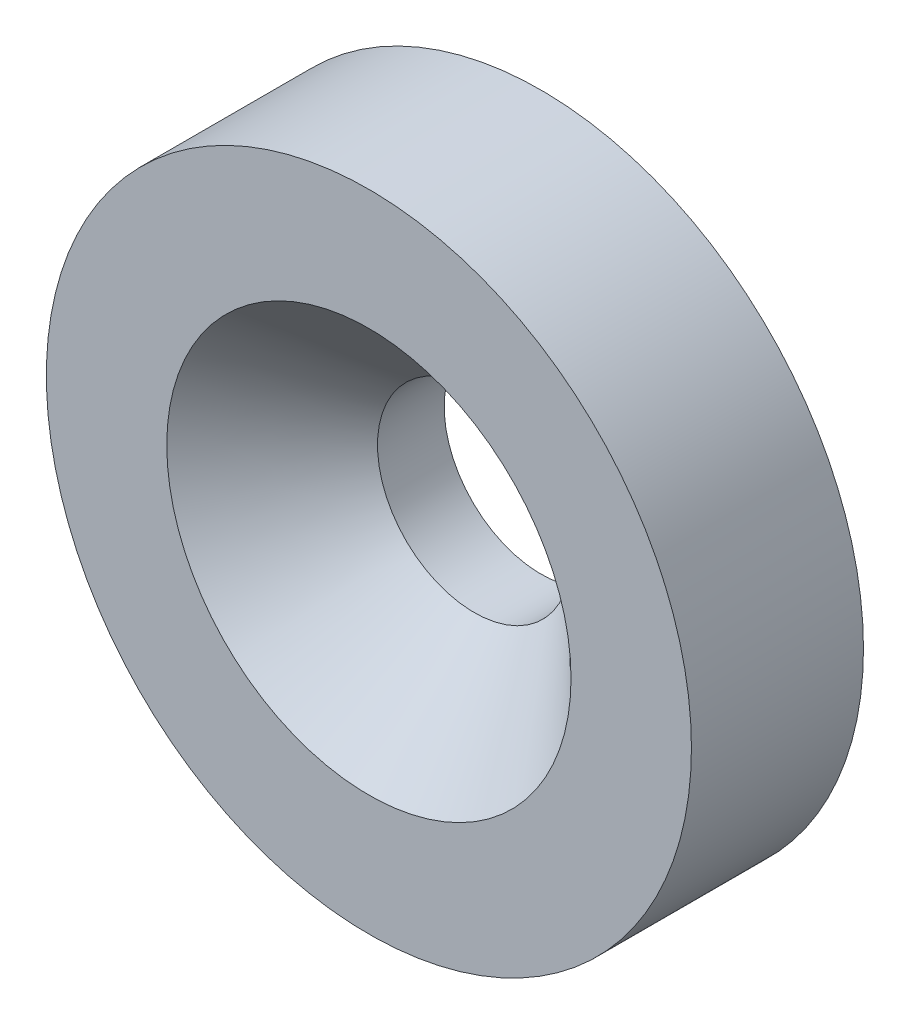
ISO-10303-21;
HEADER;
FILE_DESCRIPTION(('STEP AP214'),'2;1');
FILE_NAME('part.step','',(''),(''),'','','');
FILE_SCHEMA(('AUTOMOTIVE_DESIGN { 1 0 10303 214 1 1 1 1 }'));
ENDSEC;
DATA;
#1=APPLICATION_CONTEXT('core data for automotive mechanical design processes');
#2=APPLICATION_PROTOCOL_DEFINITION('international standard','automotive_design',2000,#1);
#3=PRODUCT_CONTEXT('',#1,'mechanical');
#4=PRODUCT('Part','Part','',(#3));
#5=PRODUCT_RELATED_PRODUCT_CATEGORY('part','',(#4));
#6=PRODUCT_DEFINITION_FORMATION('','',#4);
#7=PRODUCT_DEFINITION_CONTEXT('part definition',#1,'design');
#8=PRODUCT_DEFINITION('design','',#6,#7);
#9=PRODUCT_DEFINITION_SHAPE('','',#8);
#10=(LENGTH_UNIT() NAMED_UNIT(*) SI_UNIT(.MILLI.,.METRE.));
#11=(NAMED_UNIT(*) PLANE_ANGLE_UNIT() SI_UNIT($,.RADIAN.));
#12=(NAMED_UNIT(*) SI_UNIT($,.STERADIAN.) SOLID_ANGLE_UNIT());
#13=UNCERTAINTY_MEASURE_WITH_UNIT(LENGTH_MEASURE(1.E-05),#10,'distance_accuracy_value','');
#14=(GEOMETRIC_REPRESENTATION_CONTEXT(3) GLOBAL_UNCERTAINTY_ASSIGNED_CONTEXT((#13)) GLOBAL_UNIT_ASSIGNED_CONTEXT((#10,
#11,#12)) REPRESENTATION_CONTEXT('',''));
#15=CARTESIAN_POINT('',(0.,0.,0.));
#16=DIRECTION('',(0.,0.,1.));
#17=DIRECTION('',(1.,0.,0.));
#18=AXIS2_PLACEMENT_3D('',#15,#16,#17);
#19=CARTESIAN_POINT('',(0.,0.,-4.));
#20=DIRECTION('',(0.,0.,1.));
#21=DIRECTION('',(1.,0.,0.));
#22=AXIS2_PLACEMENT_3D('',#19,#20,#21);
#23=CYLINDRICAL_SURFACE('',#22,7.5);
#24=CARTESIAN_POINT('',(0.,0.,-4.));
#25=DIRECTION('',(0.,0.,1.));
#26=DIRECTION('',(1.,0.,0.));
#27=AXIS2_PLACEMENT_3D('',#24,#25,#26);
#28=CIRCLE('',#27,7.5);
#29=CARTESIAN_POINT('',(7.5,0.,-4.));
#30=VERTEX_POINT('',#29);
#31=EDGE_CURVE('E10',#30,#30,#28,.T.);
#32=ORIENTED_EDGE('',*,*,#31,.T.);
#33=EDGE_LOOP('',(#32));
#34=FACE_BOUND('',#33,.T.);
#35=CARTESIAN_POINT('',(0.,0.,0.));
#36=DIRECTION('',(0.,0.,1.));
#37=DIRECTION('',(1.,0.,0.));
#38=AXIS2_PLACEMENT_3D('',#35,#36,#37);
#39=CIRCLE('',#38,7.5);
#40=CARTESIAN_POINT('',(7.5,0.,0.));
#41=VERTEX_POINT('',#40);
#42=EDGE_CURVE('E38',#41,#41,#39,.T.);
#43=ORIENTED_EDGE('',*,*,#42,.F.);
#44=EDGE_LOOP('',(#43));
#45=FACE_BOUND('',#44,.T.);
#46=ADVANCED_FACE('F35',(#34,#45),#23,.T.);
#47=CARTESIAN_POINT('',(0.,0.,-4.));
#48=DIRECTION('',(0.,0.,1.));
#49=DIRECTION('',(1.,0.,0.));
#50=AXIS2_PLACEMENT_3D('',#47,#48,#49);
#51=PLANE('',#50);
#52=CARTESIAN_POINT('',(0.,0.,-4.));
#53=DIRECTION('',(0.,0.,1.));
#54=DIRECTION('',(1.,0.,0.));
#55=AXIS2_PLACEMENT_3D('',#52,#53,#54);
#56=CIRCLE('',#55,2.25);
#57=CARTESIAN_POINT('',(2.25,0.,-4.));
#58=VERTEX_POINT('',#57);
#59=EDGE_CURVE('E45',#58,#58,#56,.T.);
#60=ORIENTED_EDGE('',*,*,#59,.T.);
#61=EDGE_LOOP('',(#60));
#62=FACE_BOUND('',#61,.T.);
#63=ORIENTED_EDGE('',*,*,#31,.F.);
#64=EDGE_LOOP('',(#63));
#65=FACE_BOUND('',#64,.T.);
#66=ADVANCED_FACE('F62',(#62,#65),#51,.F.);
#67=CARTESIAN_POINT('',(0.,0.,0.));
#68=DIRECTION('',(0.,0.,1.));
#69=DIRECTION('',(1.,0.,0.));
#70=AXIS2_PLACEMENT_3D('',#67,#68,#69);
#71=PLANE('',#70);
#72=CARTESIAN_POINT('',(0.,0.,0.));
#73=DIRECTION('',(0.,0.,1.));
#74=DIRECTION('',(1.,0.,0.));
#75=AXIS2_PLACEMENT_3D('',#72,#73,#74);
#76=CIRCLE('',#75,4.7);
#77=CARTESIAN_POINT('',(4.7,0.,0.));
#78=VERTEX_POINT('',#77);
#79=EDGE_CURVE('E52',#78,#78,#76,.T.);
#80=ORIENTED_EDGE('',*,*,#79,.F.);
#81=EDGE_LOOP('',(#80));
#82=FACE_BOUND('',#81,.T.);
#83=ORIENTED_EDGE('',*,*,#42,.T.);
#84=EDGE_LOOP('',(#83));
#85=FACE_BOUND('',#84,.T.);
#86=ADVANCED_FACE('F58',(#82,#85),#71,.T.);
#87=CARTESIAN_POINT('',(0.,0.,0.));
#88=DIRECTION('',(0.,0.,1.));
#89=DIRECTION('',(1.,0.,0.));
#90=AXIS2_PLACEMENT_3D('',#87,#88,#89);
#91=CYLINDRICAL_SURFACE('',#90,2.25);
#92=ORIENTED_EDGE('',*,*,#59,.F.);
#93=EDGE_LOOP('',(#92));
#94=FACE_BOUND('',#93,.T.);
#95=CARTESIAN_POINT('',(0.,0.,-2.45));
#96=DIRECTION('',(0.,0.,1.));
#97=DIRECTION('',(1.,0.,0.));
#98=AXIS2_PLACEMENT_3D('',#95,#96,#97);
#99=CIRCLE('',#98,2.25);
#100=CARTESIAN_POINT('',(2.25,0.,-2.45));
#101=VERTEX_POINT('',#100);
#102=EDGE_CURVE('E49',#101,#101,#99,.T.);
#103=ORIENTED_EDGE('',*,*,#102,.T.);
#104=EDGE_LOOP('',(#103));
#105=FACE_BOUND('',#104,.T.);
#106=ADVANCED_FACE('F61',(#94,#105),#91,.F.);
#107=CARTESIAN_POINT('',(0.,0.,0.));
#108=DIRECTION('',(0.,0.,1.));
#109=DIRECTION('',(1.,0.,0.));
#110=AXIS2_PLACEMENT_3D('',#107,#108,#109);
#111=CONICAL_SURFACE('',#110,4.7,0.785398163397448);
#112=ORIENTED_EDGE('',*,*,#102,.F.);
#113=EDGE_LOOP('',(#112));
#114=FACE_BOUND('',#113,.T.);
#115=ORIENTED_EDGE('',*,*,#79,.T.);
#116=EDGE_LOOP('',(#115));
#117=FACE_BOUND('',#116,.T.);
#118=ADVANCED_FACE('F56',(#114,#117),#111,.F.);
#119=CLOSED_SHELL('',(#46,#66,#86,#106,#118));
#120=MANIFOLD_SOLID_BREP('B2',#119);
#121=ADVANCED_BREP_SHAPE_REPRESENTATION('',(#18,#120),#14);
#122=SHAPE_DEFINITION_REPRESENTATION(#9,#121);
ENDSEC;
END-ISO-10303-21;
